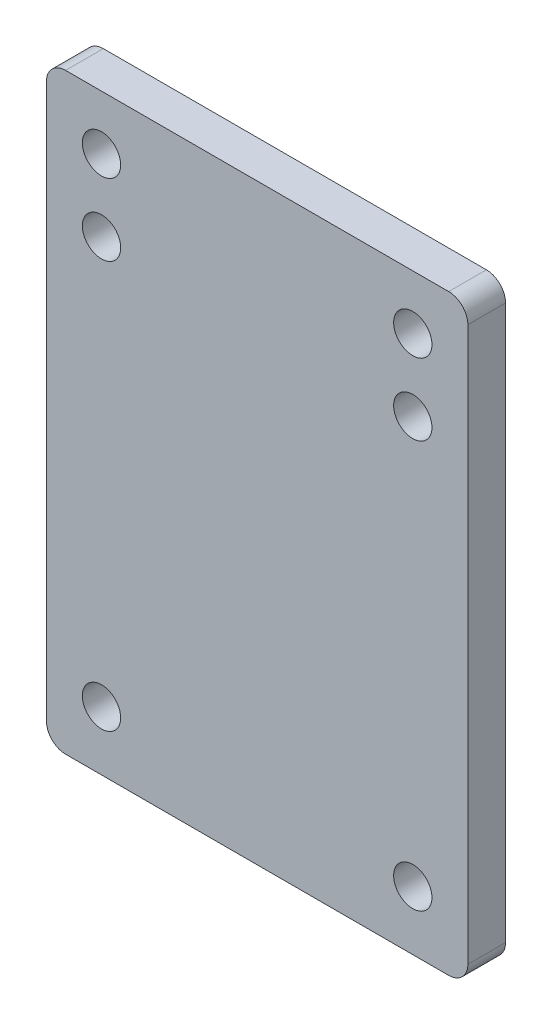
ISO-10303-21;
HEADER;
FILE_DESCRIPTION(('STEP AP214'),'2;1');
FILE_NAME('part.step','',(''),(''),'','','');
FILE_SCHEMA(('AUTOMOTIVE_DESIGN { 1 0 10303 214 1 1 1 1 }'));
ENDSEC;
DATA;
#1=APPLICATION_CONTEXT('core data for automotive mechanical design processes');
#2=APPLICATION_PROTOCOL_DEFINITION('international standard','automotive_design',2000,#1);
#3=PRODUCT_CONTEXT('',#1,'mechanical');
#4=PRODUCT('Part','Part','',(#3));
#5=PRODUCT_RELATED_PRODUCT_CATEGORY('part','',(#4));
#6=PRODUCT_DEFINITION_FORMATION('','',#4);
#7=PRODUCT_DEFINITION_CONTEXT('part definition',#1,'design');
#8=PRODUCT_DEFINITION('design','',#6,#7);
#9=PRODUCT_DEFINITION_SHAPE('','',#8);
#10=(LENGTH_UNIT() NAMED_UNIT(*) SI_UNIT(.MILLI.,.METRE.));
#11=(NAMED_UNIT(*) PLANE_ANGLE_UNIT() SI_UNIT($,.RADIAN.));
#12=(NAMED_UNIT(*) SI_UNIT($,.STERADIAN.) SOLID_ANGLE_UNIT());
#13=UNCERTAINTY_MEASURE_WITH_UNIT(LENGTH_MEASURE(1.E-05),#10,'distance_accuracy_value','');
#14=(GEOMETRIC_REPRESENTATION_CONTEXT(3) GLOBAL_UNCERTAINTY_ASSIGNED_CONTEXT((#13)) GLOBAL_UNIT_ASSIGNED_CONTEXT((#10,
#11,#12)) REPRESENTATION_CONTEXT('',''));
#15=CARTESIAN_POINT('',(0.,0.,0.));
#16=DIRECTION('',(0.,0.,1.));
#17=DIRECTION('',(1.,0.,0.));
#18=AXIS2_PLACEMENT_3D('',#15,#16,#17);
#19=CARTESIAN_POINT('',(-0.00189409449854367,-39.1659101000694,5.));
#20=DIRECTION('',(4.83607936465492E-05,0.999999998830617,0.));
#21=DIRECTION('',(-0.999999998830617,4.83607936465492E-05,0.));
#22=AXIS2_PLACEMENT_3D('',#19,#20,#21);
#23=PLANE('',#22);
#24=DIRECTION('',(0.999999998830617,-4.83607936465492E-05,0.));
#25=VECTOR('',#24,1.);
#26=CARTESIAN_POINT('',(-0.00189409449854367,-39.1659101000694,0.));
#27=LINE('',#26,#25);
#28=CARTESIAN_POINT('',(-7.87271339754547,-39.1655294610008,0.));
#29=VERTEX_POINT('',#28);
#30=CARTESIAN_POINT('',(9.8668065347864,-39.1663873582647,0.));
#31=VERTEX_POINT('',#30);
#32=EDGE_CURVE('E244',#29,#31,#27,.T.);
#33=ORIENTED_EDGE('',*,*,#32,.T.);
#34=DIRECTION('',(0.,0.,-1.));
#35=VECTOR('',#34,1.);
#36=CARTESIAN_POINT('',(9.8668065347864,-39.1663873582647,5.));
#37=LINE('',#36,#35);
#38=CARTESIAN_POINT('',(9.8668065347864,-39.1663873582647,5.));
#39=VERTEX_POINT('',#38);
#40=EDGE_CURVE('E11',#39,#31,#37,.T.);
#41=ORIENTED_EDGE('',*,*,#40,.F.);
#42=DIRECTION('',(0.999999998830617,-4.83607936465492E-05,0.));
#43=VECTOR('',#42,1.);
#44=CARTESIAN_POINT('',(-0.00189409449854367,-39.1659101000694,5.));
#45=LINE('',#44,#43);
#46=CARTESIAN_POINT('',(-7.87271339754547,-39.1655294610008,5.));
#47=VERTEX_POINT('',#46);
#48=EDGE_CURVE('E274',#47,#39,#45,.T.);
#49=ORIENTED_EDGE('',*,*,#48,.F.);
#50=DIRECTION('',(0.,0.,-1.));
#51=VECTOR('',#50,1.);
#52=CARTESIAN_POINT('',(-7.87271339754547,-39.1655294610008,5.));
#53=LINE('',#52,#51);
#54=EDGE_CURVE('E275',#47,#29,#53,.T.);
#55=ORIENTED_EDGE('',*,*,#54,.T.);
#56=EDGE_LOOP('',(#33,#41,#49,#55));
#57=FACE_BOUND('',#56,.T.);
#58=ADVANCED_FACE('F35',(#57),#23,.F.);
#59=CARTESIAN_POINT('',(-1.31712836333142E-13,-39.1663873582646,5.));
#60=DIRECTION('',(0.,1.,0.));
#61=DIRECTION('',(-1.,0.,0.));
#62=AXIS2_PLACEMENT_3D('',#59,#60,#61);
#63=PLANE('',#62);
#64=DIRECTION('',(1.,0.,0.));
#65=VECTOR('',#64,1.);
#66=CARTESIAN_POINT('',(-1.31712836333142E-13,-39.1663873582646,0.));
#67=LINE('',#66,#65);
#68=CARTESIAN_POINT('',(26.3737113464595,-39.1663873582647,0.));
#69=VERTEX_POINT('',#68);
#70=EDGE_CURVE('E238',#31,#69,#67,.T.);
#71=ORIENTED_EDGE('',*,*,#70,.T.);
#72=DIRECTION('',(0.,0.,-1.));
#73=VECTOR('',#72,1.);
#74=CARTESIAN_POINT('',(26.3737113464595,-39.1663873582647,5.));
#75=LINE('',#74,#73);
#76=CARTESIAN_POINT('',(26.3737113464595,-39.1663873582647,5.));
#77=VERTEX_POINT('',#76);
#78=EDGE_CURVE('E43',#77,#69,#75,.T.);
#79=ORIENTED_EDGE('',*,*,#78,.F.);
#80=DIRECTION('',(1.,0.,0.));
#81=VECTOR('',#80,1.);
#82=CARTESIAN_POINT('',(-1.31712836333142E-13,-39.1663873582646,5.));
#83=LINE('',#82,#81);
#84=EDGE_CURVE('E103',#39,#77,#83,.T.);
#85=ORIENTED_EDGE('',*,*,#84,.F.);
#86=ORIENTED_EDGE('',*,*,#40,.T.);
#87=EDGE_LOOP('',(#71,#79,#85,#86));
#88=FACE_BOUND('',#87,.T.);
#89=ADVANCED_FACE('F189',(#88),#63,.F.);
#90=CARTESIAN_POINT('',(26.3737113464595,-36.62290159943,5.));
#91=DIRECTION('',(0.,0.,1.));
#92=DIRECTION('',(0.,1.,0.));
#93=AXIS2_PLACEMENT_3D('',#90,#91,#92);
#94=ELLIPSE('',#93,2.54348575883473,2.54);
#95=DIRECTION('',(0.,0.,-1.));
#96=VECTOR('',#95,1.);
#97=SURFACE_OF_LINEAR_EXTRUSION('',#94,#96);
#98=CARTESIAN_POINT('',(26.3737113464595,-36.62290159943,0.));
#99=DIRECTION('',(0.,0.,1.));
#100=DIRECTION('',(0.,1.,0.));
#101=AXIS2_PLACEMENT_3D('',#98,#99,#100);
#102=ELLIPSE('',#101,2.54348575883473,2.54);
#103=CARTESIAN_POINT('',(28.9137113464595,-36.62290159943,0.));
#104=VERTEX_POINT('',#103);
#105=EDGE_CURVE('E232',#69,#104,#102,.T.);
#106=ORIENTED_EDGE('',*,*,#105,.T.);
#107=DIRECTION('',(0.,0.,-1.));
#108=VECTOR('',#107,1.);
#109=CARTESIAN_POINT('',(28.9137113464595,-36.62290159943,5.));
#110=LINE('',#109,#108);
#111=CARTESIAN_POINT('',(28.9137113464595,-36.62290159943,5.));
#112=VERTEX_POINT('',#111);
#113=EDGE_CURVE('E226',#112,#104,#110,.T.);
#114=ORIENTED_EDGE('',*,*,#113,.F.);
#115=EDGE_CURVE('E191',#77,#112,#94,.T.);
#116=ORIENTED_EDGE('',*,*,#115,.F.);
#117=ORIENTED_EDGE('',*,*,#78,.T.);
#118=EDGE_LOOP('',(#106,#114,#116,#117));
#119=FACE_BOUND('',#118,.T.);
#120=ADVANCED_FACE('F185',(#119),#97,.F.);
#121=CARTESIAN_POINT('',(28.9137113464595,0.,5.));
#122=DIRECTION('',(-1.,0.,0.));
#123=DIRECTION('',(0.,-1.,0.));
#124=AXIS2_PLACEMENT_3D('',#121,#122,#123);
#125=PLANE('',#124);
#126=DIRECTION('',(0.,1.,0.));
#127=VECTOR('',#126,1.);
#128=CARTESIAN_POINT('',(28.9137113464595,0.,0.));
#129=LINE('',#128,#127);
#130=CARTESIAN_POINT('',(28.9137113464595,36.8211296275565,0.));
#131=VERTEX_POINT('',#130);
#132=EDGE_CURVE('E240',#104,#131,#129,.T.);
#133=ORIENTED_EDGE('',*,*,#132,.T.);
#134=DIRECTION('',(0.,0.,-1.));
#135=VECTOR('',#134,1.);
#136=CARTESIAN_POINT('',(28.9137113464595,36.8211296275565,5.));
#137=LINE('',#136,#135);
#138=CARTESIAN_POINT('',(28.9137113464595,36.8211296275565,5.));
#139=VERTEX_POINT('',#138);
#140=EDGE_CURVE('E223',#139,#131,#137,.T.);
#141=ORIENTED_EDGE('',*,*,#140,.F.);
#142=DIRECTION('',(0.,1.,0.));
#143=VECTOR('',#142,1.);
#144=CARTESIAN_POINT('',(28.9137113464595,0.,5.));
#145=LINE('',#144,#143);
#146=EDGE_CURVE('E195',#112,#139,#145,.T.);
#147=ORIENTED_EDGE('',*,*,#146,.F.);
#148=ORIENTED_EDGE('',*,*,#113,.T.);
#149=EDGE_LOOP('',(#133,#141,#147,#148));
#150=FACE_BOUND('',#149,.T.);
#151=ADVANCED_FACE('F181',(#150),#125,.F.);
#152=CARTESIAN_POINT('',(26.3737113464595,36.8211296275565,5.));
#153=DIRECTION('',(0.,0.,-1.));
#154=DIRECTION('',(-1.,0.,0.));
#155=AXIS2_PLACEMENT_3D('',#152,#153,#154);
#156=CYLINDRICAL_SURFACE('',#155,2.53999999999999);
#157=CARTESIAN_POINT('',(26.3737113464595,36.8211296275565,0.));
#158=DIRECTION('',(0.,0.,1.));
#159=DIRECTION('',(1.,0.,0.));
#160=AXIS2_PLACEMENT_3D('',#157,#158,#159);
#161=CIRCLE('',#160,2.53999999999999);
#162=CARTESIAN_POINT('',(26.3737113464595,39.3611296275564,0.));
#163=VERTEX_POINT('',#162);
#164=EDGE_CURVE('E242',#131,#163,#161,.T.);
#165=ORIENTED_EDGE('',*,*,#164,.T.);
#166=DIRECTION('',(0.,0.,-1.));
#167=VECTOR('',#166,1.);
#168=CARTESIAN_POINT('',(26.3737113464595,39.3611296275564,5.));
#169=LINE('',#168,#167);
#170=CARTESIAN_POINT('',(26.3737113464595,39.3611296275564,5.));
#171=VERTEX_POINT('',#170);
#172=EDGE_CURVE('E220',#171,#163,#169,.T.);
#173=ORIENTED_EDGE('',*,*,#172,.F.);
#174=CARTESIAN_POINT('',(26.3737113464595,36.8211296275565,5.));
#175=DIRECTION('',(0.,0.,1.));
#176=DIRECTION('',(1.,0.,0.));
#177=AXIS2_PLACEMENT_3D('',#174,#175,#176);
#178=CIRCLE('',#177,2.53999999999999);
#179=EDGE_CURVE('E198',#139,#171,#178,.T.);
#180=ORIENTED_EDGE('',*,*,#179,.F.);
#181=ORIENTED_EDGE('',*,*,#140,.T.);
#182=EDGE_LOOP('',(#165,#173,#180,#181));
#183=FACE_BOUND('',#182,.T.);
#184=ADVANCED_FACE('F177',(#183),#156,.T.);
#185=CARTESIAN_POINT('',(0.,39.3611296275565,5.));
#186=DIRECTION('',(0.,-1.,0.));
#187=DIRECTION('',(1.,0.,0.));
#188=AXIS2_PLACEMENT_3D('',#185,#186,#187);
#189=PLANE('',#188);
#190=DIRECTION('',(-1.,0.,0.));
#191=VECTOR('',#190,1.);
#192=CARTESIAN_POINT('',(0.,39.3611296275565,0.));
#193=LINE('',#192,#191);
#194=CARTESIAN_POINT('',(-24.4262886535405,39.3611296275565,0.));
#195=VERTEX_POINT('',#194);
#196=EDGE_CURVE('E249',#163,#195,#193,.T.);
#197=ORIENTED_EDGE('',*,*,#196,.T.);
#198=DIRECTION('',(0.,0.,-1.));
#199=VECTOR('',#198,1.);
#200=CARTESIAN_POINT('',(-24.4262886535405,39.3611296275565,5.));
#201=LINE('',#200,#199);
#202=CARTESIAN_POINT('',(-24.4262886535405,39.3611296275565,5.));
#203=VERTEX_POINT('',#202);
#204=EDGE_CURVE('E213',#203,#195,#201,.T.);
#205=ORIENTED_EDGE('',*,*,#204,.F.);
#206=DIRECTION('',(-1.,0.,0.));
#207=VECTOR('',#206,1.);
#208=CARTESIAN_POINT('',(0.,39.3611296275565,5.));
#209=LINE('',#208,#207);
#210=EDGE_CURVE('E200',#171,#203,#209,.T.);
#211=ORIENTED_EDGE('',*,*,#210,.F.);
#212=ORIENTED_EDGE('',*,*,#172,.T.);
#213=EDGE_LOOP('',(#197,#205,#211,#212));
#214=FACE_BOUND('',#213,.T.);
#215=ADVANCED_FACE('F173',(#214),#189,.F.);
#216=CARTESIAN_POINT('',(-24.4262886535405,36.8211296275565,5.));
#217=DIRECTION('',(0.,0.,-1.));
#218=DIRECTION('',(-1.,0.,0.));
#219=AXIS2_PLACEMENT_3D('',#216,#217,#218);
#220=CYLINDRICAL_SURFACE('',#219,2.53999999999999);
#221=CARTESIAN_POINT('',(-24.4262886535405,36.8211296275565,0.));
#222=DIRECTION('',(0.,0.,1.));
#223=DIRECTION('',(1.,0.,0.));
#224=AXIS2_PLACEMENT_3D('',#221,#222,#223);
#225=CIRCLE('',#224,2.53999999999999);
#226=CARTESIAN_POINT('',(-26.9662886535405,36.8211296275565,0.));
#227=VERTEX_POINT('',#226);
#228=EDGE_CURVE('E211',#195,#227,#225,.T.);
#229=ORIENTED_EDGE('',*,*,#228,.T.);
#230=DIRECTION('',(0.,0.,-1.));
#231=VECTOR('',#230,1.);
#232=CARTESIAN_POINT('',(-26.9662886535405,36.8211296275565,5.));
#233=LINE('',#232,#231);
#234=CARTESIAN_POINT('',(-26.9662886535405,36.8211296275565,5.));
#235=VERTEX_POINT('',#234);
#236=EDGE_CURVE('E209',#235,#227,#233,.T.);
#237=ORIENTED_EDGE('',*,*,#236,.F.);
#238=CARTESIAN_POINT('',(-24.4262886535405,36.8211296275565,5.));
#239=DIRECTION('',(0.,0.,1.));
#240=DIRECTION('',(1.,0.,0.));
#241=AXIS2_PLACEMENT_3D('',#238,#239,#240);
#242=CIRCLE('',#241,2.53999999999999);
#243=EDGE_CURVE('E202',#203,#235,#242,.T.);
#244=ORIENTED_EDGE('',*,*,#243,.F.);
#245=ORIENTED_EDGE('',*,*,#204,.T.);
#246=EDGE_LOOP('',(#229,#237,#244,#245));
#247=FACE_BOUND('',#246,.T.);
#248=ADVANCED_FACE('F169',(#247),#220,.T.);
#249=CARTESIAN_POINT('',(-26.9662886535405,0.,5.));
#250=DIRECTION('',(1.,0.,0.));
#251=DIRECTION('',(0.,1.,0.));
#252=AXIS2_PLACEMENT_3D('',#249,#250,#251);
#253=PLANE('',#252);
#254=DIRECTION('',(0.,-1.,0.));
#255=VECTOR('',#254,1.);
#256=CARTESIAN_POINT('',(-26.9662886535405,0.,0.));
#257=LINE('',#256,#255);
#258=CARTESIAN_POINT('',(-26.9662886535405,-36.62290159943,0.));
#259=VERTEX_POINT('',#258);
#260=EDGE_CURVE('E215',#227,#259,#257,.T.);
#261=ORIENTED_EDGE('',*,*,#260,.T.);
#262=DIRECTION('',(0.,0.,-1.));
#263=VECTOR('',#262,1.);
#264=CARTESIAN_POINT('',(-26.9662886535405,-36.62290159943,5.));
#265=LINE('',#264,#263);
#266=CARTESIAN_POINT('',(-26.9662886535405,-36.62290159943,5.));
#267=VERTEX_POINT('',#266);
#268=EDGE_CURVE('E141',#267,#259,#265,.T.);
#269=ORIENTED_EDGE('',*,*,#268,.F.);
#270=DIRECTION('',(0.,-1.,0.));
#271=VECTOR('',#270,1.);
#272=CARTESIAN_POINT('',(-26.9662886535405,0.,5.));
#273=LINE('',#272,#271);
#274=EDGE_CURVE('E132',#235,#267,#273,.T.);
#275=ORIENTED_EDGE('',*,*,#274,.F.);
#276=ORIENTED_EDGE('',*,*,#236,.T.);
#277=EDGE_LOOP('',(#261,#269,#275,#276));
#278=FACE_BOUND('',#277,.T.);
#279=ADVANCED_FACE('F166',(#278),#253,.F.);
#280=CARTESIAN_POINT('',(-24.4262886535405,-36.62290159943,5.));
#281=DIRECTION('',(0.,0.,1.));
#282=DIRECTION('',(0.,1.,0.));
#283=AXIS2_PLACEMENT_3D('',#280,#281,#282);
#284=ELLIPSE('',#283,2.54348575883473,2.54);
#285=DIRECTION('',(0.,0.,-1.));
#286=VECTOR('',#285,1.);
#287=SURFACE_OF_LINEAR_EXTRUSION('',#284,#286);
#288=CARTESIAN_POINT('',(-24.4262886535405,-36.62290159943,0.));
#289=DIRECTION('',(0.,0.,1.));
#290=DIRECTION('',(0.,1.,0.));
#291=AXIS2_PLACEMENT_3D('',#288,#289,#290);
#292=ELLIPSE('',#291,2.54348575883473,2.54);
#293=CARTESIAN_POINT('',(-24.4262886535405,-39.1663873582647,0.));
#294=VERTEX_POINT('',#293);
#295=EDGE_CURVE('E140',#259,#294,#292,.T.);
#296=ORIENTED_EDGE('',*,*,#295,.T.);
#297=DIRECTION('',(0.,0.,-1.));
#298=VECTOR('',#297,1.);
#299=CARTESIAN_POINT('',(-24.4262886535405,-39.1663873582647,5.));
#300=LINE('',#299,#298);
#301=CARTESIAN_POINT('',(-24.4262886535405,-39.1663873582647,5.));
#302=VERTEX_POINT('',#301);
#303=EDGE_CURVE('E137',#302,#294,#300,.T.);
#304=ORIENTED_EDGE('',*,*,#303,.F.);
#305=EDGE_CURVE('E125',#267,#302,#284,.T.);
#306=ORIENTED_EDGE('',*,*,#305,.F.);
#307=ORIENTED_EDGE('',*,*,#268,.T.);
#308=EDGE_LOOP('',(#296,#304,#306,#307));
#309=FACE_BOUND('',#308,.T.);
#310=ADVANCED_FACE('F138',(#309),#287,.F.);
#311=CARTESIAN_POINT('',(0.,-39.1663873582647,5.));
#312=DIRECTION('',(0.,1.,0.));
#313=DIRECTION('',(0.,0.,1.));
#314=AXIS2_PLACEMENT_3D('',#311,#312,#313);
#315=PLANE('',#314);
#316=DIRECTION('',(1.,0.,0.));
#317=VECTOR('',#316,1.);
#318=CARTESIAN_POINT('',(0.,-39.1663873582647,0.));
#319=LINE('',#318,#317);
#320=CARTESIAN_POINT('',(-7.91938384186739,-39.1663873582647,0.));
#321=VERTEX_POINT('',#320);
#322=EDGE_CURVE('E89',#294,#321,#319,.T.);
#323=ORIENTED_EDGE('',*,*,#322,.T.);
#324=DIRECTION('',(0.,0.,-1.));
#325=VECTOR('',#324,1.);
#326=CARTESIAN_POINT('',(-7.91938384186739,-39.1663873582647,5.));
#327=LINE('',#326,#325);
#328=CARTESIAN_POINT('',(-7.91938384186739,-39.1663873582647,5.));
#329=VERTEX_POINT('',#328);
#330=EDGE_CURVE('E142',#329,#321,#327,.T.);
#331=ORIENTED_EDGE('',*,*,#330,.F.);
#332=DIRECTION('',(1.,0.,0.));
#333=VECTOR('',#332,1.);
#334=CARTESIAN_POINT('',(0.,-39.1663873582647,5.));
#335=LINE('',#334,#333);
#336=EDGE_CURVE('E130',#302,#329,#335,.T.);
#337=ORIENTED_EDGE('',*,*,#336,.F.);
#338=ORIENTED_EDGE('',*,*,#303,.T.);
#339=EDGE_LOOP('',(#323,#331,#337,#338));
#340=FACE_BOUND('',#339,.T.);
#341=ADVANCED_FACE('F144',(#340),#315,.F.);
#342=CARTESIAN_POINT('',(-19.6637886535405,22.6318126417353,5.));
#343=DIRECTION('',(0.,0.,-1.));
#344=DIRECTION('',(-1.,0.,0.));
#345=AXIS2_PLACEMENT_3D('',#342,#343,#344);
#346=CYLINDRICAL_SURFACE('',#345,2.53999999999999);
#347=CARTESIAN_POINT('',(-19.6637886535405,22.6318126417353,5.));
#348=DIRECTION('',(0.,0.,1.));
#349=DIRECTION('',(1.,0.,0.));
#350=AXIS2_PLACEMENT_3D('',#347,#348,#349);
#351=CIRCLE('',#350,2.53999999999999);
#352=CARTESIAN_POINT('',(-17.1237886535405,22.6318126417353,5.));
#353=VERTEX_POINT('',#352);
#354=EDGE_CURVE('E283',#353,#353,#351,.T.);
#355=ORIENTED_EDGE('',*,*,#354,.T.);
#356=EDGE_LOOP('',(#355));
#357=FACE_BOUND('',#356,.T.);
#358=CARTESIAN_POINT('',(-19.6637886535405,22.6318126417353,0.));
#359=DIRECTION('',(0.,0.,1.));
#360=DIRECTION('',(1.,0.,0.));
#361=AXIS2_PLACEMENT_3D('',#358,#359,#360);
#362=CIRCLE('',#361,2.53999999999999);
#363=CARTESIAN_POINT('',(-17.1237886535405,22.6318126417353,0.));
#364=VERTEX_POINT('',#363);
#365=EDGE_CURVE('E268',#364,#364,#362,.T.);
#366=ORIENTED_EDGE('',*,*,#365,.F.);
#367=EDGE_LOOP('',(#366));
#368=FACE_BOUND('',#367,.T.);
#369=ADVANCED_FACE('F163',(#357,#368),#346,.F.);
#370=CARTESIAN_POINT('',(21.6112113464595,22.6318126417352,5.));
#371=DIRECTION('',(0.,0.,-1.));
#372=DIRECTION('',(-1.,0.,0.));
#373=AXIS2_PLACEMENT_3D('',#370,#371,#372);
#374=CYLINDRICAL_SURFACE('',#373,2.53999999999999);
#375=CARTESIAN_POINT('',(21.6112113464595,22.6318126417352,5.));
#376=DIRECTION('',(0.,0.,1.));
#377=DIRECTION('',(1.,0.,0.));
#378=AXIS2_PLACEMENT_3D('',#375,#376,#377);
#379=CIRCLE('',#378,2.53999999999999);
#380=CARTESIAN_POINT('',(24.1512113464595,22.6318126417352,5.));
#381=VERTEX_POINT('',#380);
#382=EDGE_CURVE('E286',#381,#381,#379,.T.);
#383=ORIENTED_EDGE('',*,*,#382,.T.);
#384=EDGE_LOOP('',(#383));
#385=FACE_BOUND('',#384,.T.);
#386=CARTESIAN_POINT('',(21.6112113464595,22.6318126417352,0.));
#387=DIRECTION('',(0.,0.,1.));
#388=DIRECTION('',(1.,0.,0.));
#389=AXIS2_PLACEMENT_3D('',#386,#387,#388);
#390=CIRCLE('',#389,2.53999999999999);
#391=CARTESIAN_POINT('',(24.1512113464595,22.6318126417352,0.));
#392=VERTEX_POINT('',#391);
#393=EDGE_CURVE('E265',#392,#392,#390,.T.);
#394=ORIENTED_EDGE('',*,*,#393,.F.);
#395=EDGE_LOOP('',(#394));
#396=FACE_BOUND('',#395,.T.);
#397=ADVANCED_FACE('F370',(#385,#396),#374,.F.);
#398=CARTESIAN_POINT('',(21.6112113464595,32.1568126417353,5.));
#399=DIRECTION('',(0.,0.,-1.));
#400=DIRECTION('',(-1.,0.,0.));
#401=AXIS2_PLACEMENT_3D('',#398,#399,#400);
#402=CYLINDRICAL_SURFACE('',#401,2.54000000000004);
#403=CARTESIAN_POINT('',(21.6112113464595,32.1568126417353,5.));
#404=DIRECTION('',(0.,0.,1.));
#405=DIRECTION('',(1.,0.,0.));
#406=AXIS2_PLACEMENT_3D('',#403,#404,#405);
#407=CIRCLE('',#406,2.54000000000004);
#408=CARTESIAN_POINT('',(24.1512113464596,32.1568126417353,5.));
#409=VERTEX_POINT('',#408);
#410=EDGE_CURVE('E289',#409,#409,#407,.T.);
#411=ORIENTED_EDGE('',*,*,#410,.T.);
#412=EDGE_LOOP('',(#411));
#413=FACE_BOUND('',#412,.T.);
#414=CARTESIAN_POINT('',(21.6112113464595,32.1568126417353,0.));
#415=DIRECTION('',(0.,0.,1.));
#416=DIRECTION('',(1.,0.,0.));
#417=AXIS2_PLACEMENT_3D('',#414,#415,#416);
#418=CIRCLE('',#417,2.54000000000004);
#419=CARTESIAN_POINT('',(24.1512113464596,32.1568126417353,0.));
#420=VERTEX_POINT('',#419);
#421=EDGE_CURVE('E262',#420,#420,#418,.T.);
#422=ORIENTED_EDGE('',*,*,#421,.F.);
#423=EDGE_LOOP('',(#422));
#424=FACE_BOUND('',#423,.T.);
#425=ADVANCED_FACE('F378',(#413,#424),#402,.F.);
#426=CARTESIAN_POINT('',(21.6112113464595,-31.3431873582647,5.));
#427=DIRECTION('',(0.,0.,-1.));
#428=DIRECTION('',(-1.,0.,0.));
#429=AXIS2_PLACEMENT_3D('',#426,#427,#428);
#430=CYLINDRICAL_SURFACE('',#429,2.53999999999999);
#431=CARTESIAN_POINT('',(21.6112113464595,-31.3431873582647,5.));
#432=DIRECTION('',(0.,0.,1.));
#433=DIRECTION('',(1.,0.,0.));
#434=AXIS2_PLACEMENT_3D('',#431,#432,#433);
#435=CIRCLE('',#434,2.53999999999999);
#436=CARTESIAN_POINT('',(24.1512113464595,-31.3431873582647,5.));
#437=VERTEX_POINT('',#436);
#438=EDGE_CURVE('E291',#437,#437,#435,.T.);
#439=ORIENTED_EDGE('',*,*,#438,.T.);
#440=EDGE_LOOP('',(#439));
#441=FACE_BOUND('',#440,.T.);
#442=CARTESIAN_POINT('',(21.6112113464595,-31.3431873582647,0.));
#443=DIRECTION('',(0.,0.,1.));
#444=DIRECTION('',(1.,0.,0.));
#445=AXIS2_PLACEMENT_3D('',#442,#443,#444);
#446=CIRCLE('',#445,2.53999999999999);
#447=CARTESIAN_POINT('',(24.1512113464595,-31.3431873582647,0.));
#448=VERTEX_POINT('',#447);
#449=EDGE_CURVE('E259',#448,#448,#446,.T.);
#450=ORIENTED_EDGE('',*,*,#449,.F.);
#451=EDGE_LOOP('',(#450));
#452=FACE_BOUND('',#451,.T.);
#453=ADVANCED_FACE('F386',(#441,#452),#430,.F.);
#454=CARTESIAN_POINT('',(-19.6637886535405,-31.3431873582647,5.));
#455=DIRECTION('',(0.,0.,-1.));
#456=DIRECTION('',(-1.,0.,0.));
#457=AXIS2_PLACEMENT_3D('',#454,#455,#456);
#458=CYLINDRICAL_SURFACE('',#457,2.53999999999999);
#459=CARTESIAN_POINT('',(-19.6637886535405,-31.3431873582647,5.));
#460=DIRECTION('',(0.,0.,1.));
#461=DIRECTION('',(1.,0.,0.));
#462=AXIS2_PLACEMENT_3D('',#459,#460,#461);
#463=CIRCLE('',#462,2.53999999999999);
#464=CARTESIAN_POINT('',(-17.1237886535405,-31.3431873582647,5.));
#465=VERTEX_POINT('',#464);
#466=EDGE_CURVE('E146',#465,#465,#463,.T.);
#467=ORIENTED_EDGE('',*,*,#466,.T.);
#468=EDGE_LOOP('',(#467));
#469=FACE_BOUND('',#468,.T.);
#470=CARTESIAN_POINT('',(-19.6637886535405,-31.3431873582647,0.));
#471=DIRECTION('',(0.,0.,1.));
#472=DIRECTION('',(1.,0.,0.));
#473=AXIS2_PLACEMENT_3D('',#470,#471,#472);
#474=CIRCLE('',#473,2.53999999999999);
#475=CARTESIAN_POINT('',(-17.1237886535405,-31.3431873582647,0.));
#476=VERTEX_POINT('',#475);
#477=EDGE_CURVE('E256',#476,#476,#474,.T.);
#478=ORIENTED_EDGE('',*,*,#477,.F.);
#479=EDGE_LOOP('',(#478));
#480=FACE_BOUND('',#479,.T.);
#481=ADVANCED_FACE('F159',(#469,#480),#458,.F.);
#482=CARTESIAN_POINT('',(-7.9170627748,-37.8946444788474,5.));
#483=DIRECTION('',(0.,0.,1.));
#484=DIRECTION('',(-0.554505052807702,-0.83218035690031,0.));
#485=AXIS2_PLACEMENT_3D('',#482,#483,#484);
#486=ELLIPSE('',#485,1.27251594041553,1.27000000000009);
#487=DIRECTION('',(0.,0.,-1.));
#488=VECTOR('',#487,1.);
#489=SURFACE_OF_LINEAR_EXTRUSION('',#486,#488);
#490=CARTESIAN_POINT('',(-7.9170627748,-37.8946444788474,0.));
#491=DIRECTION('',(0.,0.,1.));
#492=DIRECTION('',(-0.554505052807702,-0.83218035690031,0.));
#493=AXIS2_PLACEMENT_3D('',#490,#491,#492);
#494=ELLIPSE('',#493,1.27251594041553,1.27000000000009);
#495=EDGE_CURVE('E95',#321,#29,#494,.T.);
#496=ORIENTED_EDGE('',*,*,#495,.T.);
#497=ORIENTED_EDGE('',*,*,#54,.F.);
#498=EDGE_CURVE('E51',#329,#47,#486,.T.);
#499=ORIENTED_EDGE('',*,*,#498,.F.);
#500=ORIENTED_EDGE('',*,*,#330,.T.);
#501=EDGE_LOOP('',(#496,#497,#499,#500));
#502=FACE_BOUND('',#501,.T.);
#503=ADVANCED_FACE('F154',(#502),#489,.F.);
#504=CARTESIAN_POINT('',(-19.6637886535405,32.1568126417353,5.));
#505=DIRECTION('',(0.,0.,-1.));
#506=DIRECTION('',(-1.,0.,0.));
#507=AXIS2_PLACEMENT_3D('',#504,#505,#506);
#508=CYLINDRICAL_SURFACE('',#507,2.53999999999999);
#509=CARTESIAN_POINT('',(-19.6637886535405,32.1568126417353,5.));
#510=DIRECTION('',(0.,0.,1.));
#511=DIRECTION('',(1.,0.,0.));
#512=AXIS2_PLACEMENT_3D('',#509,#510,#511);
#513=CIRCLE('',#512,2.53999999999999);
#514=CARTESIAN_POINT('',(-17.1237886535405,32.1568126417353,5.));
#515=VERTEX_POINT('',#514);
#516=EDGE_CURVE('E276',#515,#515,#513,.T.);
#517=ORIENTED_EDGE('',*,*,#516,.T.);
#518=EDGE_LOOP('',(#517));
#519=FACE_BOUND('',#518,.T.);
#520=CARTESIAN_POINT('',(-19.6637886535405,32.1568126417353,0.));
#521=DIRECTION('',(0.,0.,1.));
#522=DIRECTION('',(1.,0.,0.));
#523=AXIS2_PLACEMENT_3D('',#520,#521,#522);
#524=CIRCLE('',#523,2.53999999999999);
#525=CARTESIAN_POINT('',(-17.1237886535405,32.1568126417353,0.));
#526=VERTEX_POINT('',#525);
#527=EDGE_CURVE('E271',#526,#526,#524,.T.);
#528=ORIENTED_EDGE('',*,*,#527,.F.);
#529=EDGE_LOOP('',(#528));
#530=FACE_BOUND('',#529,.T.);
#531=ADVANCED_FACE('F158',(#519,#530),#508,.F.);
#532=CARTESIAN_POINT('',(0.,0.,5.));
#533=DIRECTION('',(0.,0.,1.));
#534=DIRECTION('',(1.,0.,0.));
#535=AXIS2_PLACEMENT_3D('',#532,#533,#534);
#536=PLANE('',#535);
#537=ORIENTED_EDGE('',*,*,#48,.T.);
#538=ORIENTED_EDGE('',*,*,#84,.T.);
#539=ORIENTED_EDGE('',*,*,#115,.T.);
#540=ORIENTED_EDGE('',*,*,#146,.T.);
#541=ORIENTED_EDGE('',*,*,#179,.T.);
#542=ORIENTED_EDGE('',*,*,#210,.T.);
#543=ORIENTED_EDGE('',*,*,#243,.T.);
#544=ORIENTED_EDGE('',*,*,#274,.T.);
#545=ORIENTED_EDGE('',*,*,#305,.T.);
#546=ORIENTED_EDGE('',*,*,#336,.T.);
#547=ORIENTED_EDGE('',*,*,#498,.T.);
#548=EDGE_LOOP('',(#537,#538,#539,#540,#541,#542,#543,#544,#545,#546,#547));
#549=FACE_BOUND('',#548,.T.);
#550=ORIENTED_EDGE('',*,*,#466,.F.);
#551=EDGE_LOOP('',(#550));
#552=FACE_BOUND('',#551,.T.);
#553=ORIENTED_EDGE('',*,*,#438,.F.);
#554=EDGE_LOOP('',(#553));
#555=FACE_BOUND('',#554,.T.);
#556=ORIENTED_EDGE('',*,*,#410,.F.);
#557=EDGE_LOOP('',(#556));
#558=FACE_BOUND('',#557,.T.);
#559=ORIENTED_EDGE('',*,*,#382,.F.);
#560=EDGE_LOOP('',(#559));
#561=FACE_BOUND('',#560,.T.);
#562=ORIENTED_EDGE('',*,*,#354,.F.);
#563=EDGE_LOOP('',(#562));
#564=FACE_BOUND('',#563,.T.);
#565=ORIENTED_EDGE('',*,*,#516,.F.);
#566=EDGE_LOOP('',(#565));
#567=FACE_BOUND('',#566,.T.);
#568=ADVANCED_FACE('F127',(#549,#552,#555,#558,#561,#564,#567),#536,.T.);
#569=CARTESIAN_POINT('',(0.,0.,0.));
#570=DIRECTION('',(0.,0.,1.));
#571=DIRECTION('',(1.,0.,0.));
#572=AXIS2_PLACEMENT_3D('',#569,#570,#571);
#573=PLANE('',#572);
#574=ORIENTED_EDGE('',*,*,#32,.F.);
#575=ORIENTED_EDGE('',*,*,#495,.F.);
#576=ORIENTED_EDGE('',*,*,#322,.F.);
#577=ORIENTED_EDGE('',*,*,#295,.F.);
#578=ORIENTED_EDGE('',*,*,#260,.F.);
#579=ORIENTED_EDGE('',*,*,#228,.F.);
#580=ORIENTED_EDGE('',*,*,#196,.F.);
#581=ORIENTED_EDGE('',*,*,#164,.F.);
#582=ORIENTED_EDGE('',*,*,#132,.F.);
#583=ORIENTED_EDGE('',*,*,#105,.F.);
#584=ORIENTED_EDGE('',*,*,#70,.F.);
#585=EDGE_LOOP('',(#574,#575,#576,#577,#578,#579,#580,#581,#582,#583,#584));
#586=FACE_BOUND('',#585,.T.);
#587=ORIENTED_EDGE('',*,*,#477,.T.);
#588=EDGE_LOOP('',(#587));
#589=FACE_BOUND('',#588,.T.);
#590=ORIENTED_EDGE('',*,*,#449,.T.);
#591=EDGE_LOOP('',(#590));
#592=FACE_BOUND('',#591,.T.);
#593=ORIENTED_EDGE('',*,*,#421,.T.);
#594=EDGE_LOOP('',(#593));
#595=FACE_BOUND('',#594,.T.);
#596=ORIENTED_EDGE('',*,*,#393,.T.);
#597=EDGE_LOOP('',(#596));
#598=FACE_BOUND('',#597,.T.);
#599=ORIENTED_EDGE('',*,*,#365,.T.);
#600=EDGE_LOOP('',(#599));
#601=FACE_BOUND('',#600,.T.);
#602=ORIENTED_EDGE('',*,*,#527,.T.);
#603=EDGE_LOOP('',(#602));
#604=FACE_BOUND('',#603,.T.);
#605=ADVANCED_FACE('F236',(#586,#589,#592,#595,#598,#601,#604),#573,.F.);
#606=CLOSED_SHELL('',(#58,#89,#120,#151,#184,#215,#248,#279,#310,#341,#369,#397,#425,#453,#481,
#503,#531,#568,#605));
#607=MANIFOLD_SOLID_BREP('B2',#606);
#608=ADVANCED_BREP_SHAPE_REPRESENTATION('',(#18,#607),#14);
#609=SHAPE_DEFINITION_REPRESENTATION(#9,#608);
ENDSEC;
END-ISO-10303-21;
